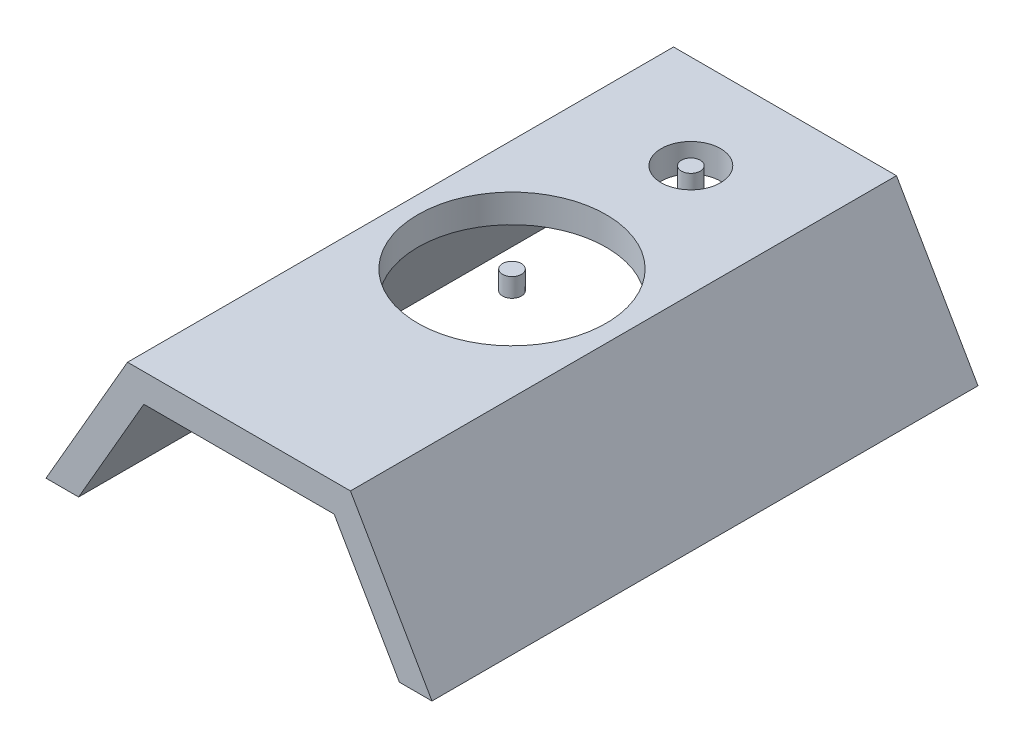
ISO-10303-21;
HEADER;
FILE_DESCRIPTION(('STEP AP214'),'2;1');
FILE_NAME('part.step','',(''),(''),'','','');
FILE_SCHEMA(('AUTOMOTIVE_DESIGN { 1 0 10303 214 1 1 1 1 }'));
ENDSEC;
DATA;
#1=APPLICATION_CONTEXT('core data for automotive mechanical design processes');
#2=APPLICATION_PROTOCOL_DEFINITION('international standard','automotive_design',2000,#1);
#3=PRODUCT_CONTEXT('',#1,'mechanical');
#4=PRODUCT('Part','Part','',(#3));
#5=PRODUCT_RELATED_PRODUCT_CATEGORY('part','',(#4));
#6=PRODUCT_DEFINITION_FORMATION('','',#4);
#7=PRODUCT_DEFINITION_CONTEXT('part definition',#1,'design');
#8=PRODUCT_DEFINITION('design','',#6,#7);
#9=PRODUCT_DEFINITION_SHAPE('','',#8);
#10=(LENGTH_UNIT() NAMED_UNIT(*) SI_UNIT(.MILLI.,.METRE.));
#11=(NAMED_UNIT(*) PLANE_ANGLE_UNIT() SI_UNIT($,.RADIAN.));
#12=(NAMED_UNIT(*) SI_UNIT($,.STERADIAN.) SOLID_ANGLE_UNIT());
#13=UNCERTAINTY_MEASURE_WITH_UNIT(LENGTH_MEASURE(1.E-05),#10,'distance_accuracy_value','');
#14=(GEOMETRIC_REPRESENTATION_CONTEXT(3) GLOBAL_UNCERTAINTY_ASSIGNED_CONTEXT((#13)) GLOBAL_UNIT_ASSIGNED_CONTEXT((#10,
#11,#12)) REPRESENTATION_CONTEXT('',''));
#15=CARTESIAN_POINT('',(0.,0.,0.));
#16=DIRECTION('',(0.,0.,1.));
#17=DIRECTION('',(1.,0.,0.));
#18=AXIS2_PLACEMENT_3D('',#15,#16,#17);
#19=CARTESIAN_POINT('',(118.403810791249,10.,100.));
#20=DIRECTION('',(0.,1.,0.));
#21=DIRECTION('',(-1.,0.,0.));
#22=AXIS2_PLACEMENT_3D('',#19,#20,#21);
#23=CYLINDRICAL_SURFACE('',#22,9.99999999999999);
#24=CARTESIAN_POINT('',(118.403810791249,10.,100.));
#25=DIRECTION('',(0.,1.,0.));
#26=DIRECTION('',(-1.,0.,0.));
#27=AXIS2_PLACEMENT_3D('',#24,#25,#26);
#28=CIRCLE('',#27,9.99999999999999);
#29=CARTESIAN_POINT('',(108.403810791249,10.,100.));
#30=VERTEX_POINT('',#29);
#31=EDGE_CURVE('E11',#30,#30,#28,.T.);
#32=ORIENTED_EDGE('',*,*,#31,.T.);
#33=EDGE_LOOP('',(#32));
#34=FACE_BOUND('',#33,.T.);
#35=CARTESIAN_POINT('',(118.403810791249,30.,100.));
#36=DIRECTION('',(0.,1.,0.));
#37=DIRECTION('',(-1.,0.,0.));
#38=AXIS2_PLACEMENT_3D('',#35,#36,#37);
#39=CIRCLE('',#38,9.99999999999999);
#40=CARTESIAN_POINT('',(108.403810791249,30.,100.));
#41=VERTEX_POINT('',#40);
#42=EDGE_CURVE('E47',#41,#41,#39,.T.);
#43=ORIENTED_EDGE('',*,*,#42,.F.);
#44=EDGE_LOOP('',(#43));
#45=FACE_BOUND('',#44,.T.);
#46=ADVANCED_FACE('F44',(#34,#45),#23,.T.);
#47=CARTESIAN_POINT('',(118.403810791249,10.,100.));
#48=DIRECTION('',(0.,1.,0.));
#49=DIRECTION('',(-1.,0.,0.));
#50=AXIS2_PLACEMENT_3D('',#47,#48,#49);
#51=PLANE('',#50);
#52=ORIENTED_EDGE('',*,*,#31,.F.);
#53=EDGE_LOOP('',(#52));
#54=FACE_BOUND('',#53,.T.);
#55=ADVANCED_FACE('F59',(#54),#51,.F.);
#56=CARTESIAN_POINT('',(118.403810791249,30.,100.));
#57=DIRECTION('',(0.,1.,0.));
#58=DIRECTION('',(-1.,0.,0.));
#59=AXIS2_PLACEMENT_3D('',#56,#57,#58);
#60=PLANE('',#59);
#61=ORIENTED_EDGE('',*,*,#42,.T.);
#62=EDGE_LOOP('',(#61));
#63=FACE_BOUND('',#62,.T.);
#64=ADVANCED_FACE('F56',(#63),#60,.T.);
#65=CLOSED_SHELL('',(#46,#55,#64));
#66=MANIFOLD_SOLID_BREP('B2',#65);
#67=CARTESIAN_POINT('',(118.403810791249,10.,290.));
#68=DIRECTION('',(0.,1.,0.));
#69=DIRECTION('',(-1.,0.,0.));
#70=AXIS2_PLACEMENT_3D('',#67,#68,#69);
#71=CYLINDRICAL_SURFACE('',#70,10.);
#72=CARTESIAN_POINT('',(118.403810791249,10.,290.));
#73=DIRECTION('',(0.,1.,0.));
#74=DIRECTION('',(-1.,0.,0.));
#75=AXIS2_PLACEMENT_3D('',#72,#73,#74);
#76=CIRCLE('',#75,10.);
#77=CARTESIAN_POINT('',(108.403810791249,10.,290.));
#78=VERTEX_POINT('',#77);
#79=EDGE_CURVE('E43',#78,#78,#76,.T.);
#80=ORIENTED_EDGE('',*,*,#79,.T.);
#81=EDGE_LOOP('',(#80));
#82=FACE_BOUND('',#81,.T.);
#83=CARTESIAN_POINT('',(118.403810791249,30.,290.));
#84=DIRECTION('',(0.,1.,0.));
#85=DIRECTION('',(-1.,0.,0.));
#86=AXIS2_PLACEMENT_3D('',#83,#84,#85);
#87=CIRCLE('',#86,10.);
#88=CARTESIAN_POINT('',(108.403810791249,30.,290.));
#89=VERTEX_POINT('',#88);
#90=EDGE_CURVE('E96',#89,#89,#87,.T.);
#91=ORIENTED_EDGE('',*,*,#90,.F.);
#92=EDGE_LOOP('',(#91));
#93=FACE_BOUND('',#92,.T.);
#94=ADVANCED_FACE('F93',(#82,#93),#71,.T.);
#95=CARTESIAN_POINT('',(118.403810791249,10.,290.));
#96=DIRECTION('',(0.,1.,0.));
#97=DIRECTION('',(-1.,0.,0.));
#98=AXIS2_PLACEMENT_3D('',#95,#96,#97);
#99=PLANE('',#98);
#100=ORIENTED_EDGE('',*,*,#79,.F.);
#101=EDGE_LOOP('',(#100));
#102=FACE_BOUND('',#101,.T.);
#103=ADVANCED_FACE('F108',(#102),#99,.F.);
#104=CARTESIAN_POINT('',(118.403810791249,30.,290.));
#105=DIRECTION('',(0.,1.,0.));
#106=DIRECTION('',(-1.,0.,0.));
#107=AXIS2_PLACEMENT_3D('',#104,#105,#106);
#108=PLANE('',#107);
#109=ORIENTED_EDGE('',*,*,#90,.T.);
#110=EDGE_LOOP('',(#109));
#111=FACE_BOUND('',#110,.T.);
#112=ADVANCED_FACE('F105',(#111),#108,.T.);
#113=CLOSED_SHELL('',(#94,#103,#112));
#114=MANIFOLD_SOLID_BREP('B6',#113);
#115=CARTESIAN_POINT('',(-12.9896188202629,7.49867992255546,580.));
#116=DIRECTION('',(0.866050808314088,-0.499955995482118,0.));
#117=DIRECTION('',(0.499955995482118,0.866050808314088,0.));
#118=AXIS2_PLACEMENT_3D('',#115,#116,#117);
#119=PLANE('',#118);
#120=DIRECTION('',(-0.499955995482118,-0.866050808314088,0.));
#121=VECTOR('',#120,1.);
#122=CARTESIAN_POINT('',(-12.9896188202629,7.49867992255546,0.));
#123=LINE('',#122,#121);
#124=CARTESIAN_POINT('',(0.,30.,0.));
#125=VERTEX_POINT('',#124);
#126=CARTESIAN_POINT('',(-86.5923784175028,-120.,0.));
#127=VERTEX_POINT('',#126);
#128=EDGE_CURVE('E229',#125,#127,#123,.T.);
#129=ORIENTED_EDGE('',*,*,#128,.T.);
#130=DIRECTION('',(0.,0.,-1.));
#131=VECTOR('',#130,1.);
#132=CARTESIAN_POINT('',(-86.5923784175028,-120.,580.));
#133=LINE('',#132,#131);
#134=CARTESIAN_POINT('',(-86.5923784175028,-120.,580.));
#135=VERTEX_POINT('',#134);
#136=EDGE_CURVE('E91',#135,#127,#133,.T.);
#137=ORIENTED_EDGE('',*,*,#136,.F.);
#138=DIRECTION('',(-0.499955995482118,-0.866050808314088,0.));
#139=VECTOR('',#138,1.);
#140=CARTESIAN_POINT('',(-12.9896188202629,7.49867992255546,580.));
#141=LINE('',#140,#139);
#142=CARTESIAN_POINT('',(0.,30.,580.));
#143=VERTEX_POINT('',#142);
#144=EDGE_CURVE('E249',#143,#135,#141,.T.);
#145=ORIENTED_EDGE('',*,*,#144,.F.);
#146=DIRECTION('',(0.,0.,-1.));
#147=VECTOR('',#146,1.);
#148=CARTESIAN_POINT('',(0.,30.,580.));
#149=LINE('',#148,#147);
#150=EDGE_CURVE('E149',#143,#125,#149,.T.);
#151=ORIENTED_EDGE('',*,*,#150,.T.);
#152=EDGE_LOOP('',(#129,#137,#145,#151));
#153=FACE_BOUND('',#152,.T.);
#154=ADVANCED_FACE('F133',(#153),#119,.F.);
#155=CARTESIAN_POINT('',(0.,-120.,580.));
#156=DIRECTION('',(0.,1.,0.));
#157=DIRECTION('',(0.,0.,1.));
#158=AXIS2_PLACEMENT_3D('',#155,#156,#157);
#159=PLANE('',#158);
#160=DIRECTION('',(1.,0.,0.));
#161=VECTOR('',#160,1.);
#162=CARTESIAN_POINT('',(0.,-120.,0.));
#163=LINE('',#162,#161);
#164=CARTESIAN_POINT('',(-51.9554270505017,-120.,0.));
#165=VERTEX_POINT('',#164);
#166=EDGE_CURVE('E231',#127,#165,#163,.T.);
#167=ORIENTED_EDGE('',*,*,#166,.T.);
#168=DIRECTION('',(0.,0.,-1.));
#169=VECTOR('',#168,1.);
#170=CARTESIAN_POINT('',(-51.9554270505017,-120.,580.));
#171=LINE('',#170,#169);
#172=CARTESIAN_POINT('',(-51.9554270505017,-120.,580.));
#173=VERTEX_POINT('',#172);
#174=EDGE_CURVE('E141',#173,#165,#171,.T.);
#175=ORIENTED_EDGE('',*,*,#174,.F.);
#176=DIRECTION('',(1.,0.,0.));
#177=VECTOR('',#176,1.);
#178=CARTESIAN_POINT('',(0.,-120.,580.));
#179=LINE('',#178,#177);
#180=EDGE_CURVE('E187',#135,#173,#179,.T.);
#181=ORIENTED_EDGE('',*,*,#180,.F.);
#182=ORIENTED_EDGE('',*,*,#136,.T.);
#183=EDGE_LOOP('',(#167,#175,#181,#182));
#184=FACE_BOUND('',#183,.T.);
#185=ADVANCED_FACE('F263',(#184),#159,.F.);
#186=CARTESIAN_POINT('',(12.9896188202629,-7.49867992255546,580.));
#187=DIRECTION('',(0.866050808314088,-0.499955995482118,0.));
#188=DIRECTION('',(0.499955995482118,0.866050808314088,0.));
#189=AXIS2_PLACEMENT_3D('',#186,#187,#188);
#190=PLANE('',#189);
#191=DIRECTION('',(-0.499955995482118,-0.866050808314088,0.));
#192=VECTOR('',#191,1.);
#193=CARTESIAN_POINT('',(12.9896188202629,-7.49867992255546,0.));
#194=LINE('',#193,#192);
#195=CARTESIAN_POINT('',(17.3184756835006,0.,0.));
#196=VERTEX_POINT('',#195);
#197=EDGE_CURVE('E235',#196,#165,#194,.T.);
#198=ORIENTED_EDGE('',*,*,#197,.F.);
#199=DIRECTION('',(0.,0.,-1.));
#200=VECTOR('',#199,1.);
#201=CARTESIAN_POINT('',(17.3184756835006,0.,580.));
#202=LINE('',#201,#200);
#203=CARTESIAN_POINT('',(17.3184756835006,0.,580.));
#204=VERTEX_POINT('',#203);
#205=EDGE_CURVE('E256',#204,#196,#202,.T.);
#206=ORIENTED_EDGE('',*,*,#205,.F.);
#207=DIRECTION('',(-0.499955995482118,-0.866050808314088,0.));
#208=VECTOR('',#207,1.);
#209=CARTESIAN_POINT('',(12.9896188202629,-7.49867992255546,580.));
#210=LINE('',#209,#208);
#211=EDGE_CURVE('E262',#204,#173,#210,.T.);
#212=ORIENTED_EDGE('',*,*,#211,.T.);
#213=ORIENTED_EDGE('',*,*,#174,.T.);
#214=EDGE_LOOP('',(#198,#206,#212,#213));
#215=FACE_BOUND('',#214,.T.);
#216=ADVANCED_FACE('F260',(#215),#190,.T.);
#217=CARTESIAN_POINT('',(0.,0.,580.));
#218=DIRECTION('',(0.,1.,0.));
#219=DIRECTION('',(-1.,0.,0.));
#220=AXIS2_PLACEMENT_3D('',#217,#218,#219);
#221=PLANE('',#220);
#222=CARTESIAN_POINT('',(118.403810791249,0.,100.));
#223=DIRECTION('',(0.,1.,0.));
#224=DIRECTION('',(-1.,0.,0.));
#225=AXIS2_PLACEMENT_3D('',#222,#223,#224);
#226=CIRCLE('',#225,31.5);
#227=CARTESIAN_POINT('',(86.9038107912486,0.,100.));
#228=VERTEX_POINT('',#227);
#229=EDGE_CURVE('E286',#228,#228,#226,.F.);
#230=ORIENTED_EDGE('',*,*,#229,.F.);
#231=EDGE_LOOP('',(#230));
#232=FACE_BOUND('',#231,.T.);
#233=CARTESIAN_POINT('',(118.403810791249,0.,290.));
#234=DIRECTION('',(0.,1.,0.));
#235=DIRECTION('',(-1.,0.,0.));
#236=AXIS2_PLACEMENT_3D('',#233,#234,#235);
#237=CIRCLE('',#236,100.);
#238=CARTESIAN_POINT('',(18.4038107912486,0.,290.));
#239=VERTEX_POINT('',#238);
#240=EDGE_CURVE('E232',#239,#239,#237,.F.);
#241=ORIENTED_EDGE('',*,*,#240,.F.);
#242=EDGE_LOOP('',(#241));
#243=FACE_BOUND('',#242,.T.);
#244=DIRECTION('',(1.,0.,0.));
#245=VECTOR('',#244,1.);
#246=CARTESIAN_POINT('',(0.,0.,0.));
#247=LINE('',#246,#245);
#248=CARTESIAN_POINT('',(219.489145898997,0.,0.));
#249=VERTEX_POINT('',#248);
#250=EDGE_CURVE('E238',#196,#249,#247,.T.);
#251=ORIENTED_EDGE('',*,*,#250,.T.);
#252=DIRECTION('',(0.,0.,-1.));
#253=VECTOR('',#252,1.);
#254=CARTESIAN_POINT('',(219.489145898997,0.,580.));
#255=LINE('',#254,#253);
#256=CARTESIAN_POINT('',(219.489145898997,0.,580.));
#257=VERTEX_POINT('',#256);
#258=EDGE_CURVE('E253',#257,#249,#255,.T.);
#259=ORIENTED_EDGE('',*,*,#258,.F.);
#260=DIRECTION('',(1.,0.,0.));
#261=VECTOR('',#260,1.);
#262=CARTESIAN_POINT('',(0.,0.,580.));
#263=LINE('',#262,#261);
#264=EDGE_CURVE('E275',#204,#257,#263,.T.);
#265=ORIENTED_EDGE('',*,*,#264,.F.);
#266=ORIENTED_EDGE('',*,*,#205,.T.);
#267=EDGE_LOOP('',(#251,#259,#265,#266));
#268=FACE_BOUND('',#267,.T.);
#269=ADVANCED_FACE('F271',(#232,#243,#268),#221,.F.);
#270=CARTESIAN_POINT('',(164.626517513275,95.0360113471011,580.));
#271=DIRECTION('',(0.866050808314087,0.499955995482118,0.));
#272=DIRECTION('',(-0.499955995482118,0.866050808314087,0.));
#273=AXIS2_PLACEMENT_3D('',#270,#271,#272);
#274=PLANE('',#273);
#275=DIRECTION('',(0.499955995482118,-0.866050808314087,0.));
#276=VECTOR('',#275,1.);
#277=CARTESIAN_POINT('',(164.626517513275,95.0360113471011,0.));
#278=LINE('',#277,#276);
#279=CARTESIAN_POINT('',(288.763048632999,-120.,0.));
#280=VERTEX_POINT('',#279);
#281=EDGE_CURVE('E240',#249,#280,#278,.T.);
#282=ORIENTED_EDGE('',*,*,#281,.T.);
#283=DIRECTION('',(0.,0.,-1.));
#284=VECTOR('',#283,1.);
#285=CARTESIAN_POINT('',(288.763048632999,-120.,580.));
#286=LINE('',#285,#284);
#287=CARTESIAN_POINT('',(288.763048632999,-120.,580.));
#288=VERTEX_POINT('',#287);
#289=EDGE_CURVE('E212',#288,#280,#286,.T.);
#290=ORIENTED_EDGE('',*,*,#289,.F.);
#291=DIRECTION('',(0.499955995482118,-0.866050808314087,0.));
#292=VECTOR('',#291,1.);
#293=CARTESIAN_POINT('',(164.626517513275,95.0360113471011,580.));
#294=LINE('',#293,#292);
#295=EDGE_CURVE('E220',#257,#288,#294,.T.);
#296=ORIENTED_EDGE('',*,*,#295,.F.);
#297=ORIENTED_EDGE('',*,*,#258,.T.);
#298=EDGE_LOOP('',(#282,#290,#296,#297));
#299=FACE_BOUND('',#298,.T.);
#300=ADVANCED_FACE('F274',(#299),#274,.F.);
#301=CARTESIAN_POINT('',(0.,-120.,580.));
#302=DIRECTION('',(0.,-1.,0.));
#303=DIRECTION('',(1.,0.,0.));
#304=AXIS2_PLACEMENT_3D('',#301,#302,#303);
#305=PLANE('',#304);
#306=DIRECTION('',(-1.,0.,0.));
#307=VECTOR('',#306,1.);
#308=CARTESIAN_POINT('',(0.,-120.,0.));
#309=LINE('',#308,#307);
#310=CARTESIAN_POINT('',(323.407621582497,-120.,0.));
#311=VERTEX_POINT('',#310);
#312=EDGE_CURVE('E208',#311,#280,#309,.T.);
#313=ORIENTED_EDGE('',*,*,#312,.F.);
#314=DIRECTION('',(0.,0.,-1.));
#315=VECTOR('',#314,1.);
#316=CARTESIAN_POINT('',(323.407621582497,-120.,580.));
#317=LINE('',#316,#315);
#318=CARTESIAN_POINT('',(323.407621582497,-120.,580.));
#319=VERTEX_POINT('',#318);
#320=EDGE_CURVE('E203',#319,#311,#317,.T.);
#321=ORIENTED_EDGE('',*,*,#320,.F.);
#322=DIRECTION('',(-1.,0.,0.));
#323=VECTOR('',#322,1.);
#324=CARTESIAN_POINT('',(0.,-120.,580.));
#325=LINE('',#324,#323);
#326=EDGE_CURVE('E206',#319,#288,#325,.T.);
#327=ORIENTED_EDGE('',*,*,#326,.T.);
#328=ORIENTED_EDGE('',*,*,#289,.T.);
#329=EDGE_LOOP('',(#313,#321,#327,#328));
#330=FACE_BOUND('',#329,.T.);
#331=ADVANCED_FACE('F205',(#330),#305,.T.);
#332=CARTESIAN_POINT('',(190.59851163171,110.038874048707,580.));
#333=DIRECTION('',(0.86603175470726,0.499988999717658,0.));
#334=DIRECTION('',(-0.499988999717658,0.86603175470726,0.));
#335=AXIS2_PLACEMENT_3D('',#332,#333,#334);
#336=PLANE('',#335);
#337=DIRECTION('',(0.499988999717658,-0.86603175470726,0.));
#338=VECTOR('',#337,1.);
#339=CARTESIAN_POINT('',(190.59851163171,110.038874048707,0.));
#340=LINE('',#339,#338);
#341=CARTESIAN_POINT('',(236.807621582497,30.,0.));
#342=VERTEX_POINT('',#341);
#343=EDGE_CURVE('E244',#342,#311,#340,.T.);
#344=ORIENTED_EDGE('',*,*,#343,.F.);
#345=DIRECTION('',(0.,0.,-1.));
#346=VECTOR('',#345,1.);
#347=CARTESIAN_POINT('',(236.807621582497,30.,580.));
#348=LINE('',#347,#346);
#349=CARTESIAN_POINT('',(236.807621582497,30.,580.));
#350=VERTEX_POINT('',#349);
#351=EDGE_CURVE('E175',#350,#342,#348,.T.);
#352=ORIENTED_EDGE('',*,*,#351,.F.);
#353=DIRECTION('',(0.499988999717658,-0.86603175470726,0.));
#354=VECTOR('',#353,1.);
#355=CARTESIAN_POINT('',(190.59851163171,110.038874048707,580.));
#356=LINE('',#355,#354);
#357=EDGE_CURVE('E218',#350,#319,#356,.T.);
#358=ORIENTED_EDGE('',*,*,#357,.T.);
#359=ORIENTED_EDGE('',*,*,#320,.T.);
#360=EDGE_LOOP('',(#344,#352,#358,#359));
#361=FACE_BOUND('',#360,.T.);
#362=ADVANCED_FACE('F223',(#361),#336,.T.);
#363=CARTESIAN_POINT('',(0.,30.,580.));
#364=DIRECTION('',(0.,1.,0.));
#365=DIRECTION('',(-1.,0.,0.));
#366=AXIS2_PLACEMENT_3D('',#363,#364,#365);
#367=PLANE('',#366);
#368=CARTESIAN_POINT('',(118.403810791249,30.,100.));
#369=DIRECTION('',(0.,1.,0.));
#370=DIRECTION('',(-1.,0.,0.));
#371=AXIS2_PLACEMENT_3D('',#368,#369,#370);
#372=CIRCLE('',#371,31.5);
#373=CARTESIAN_POINT('',(86.9038107912486,30.,100.));
#374=VERTEX_POINT('',#373);
#375=EDGE_CURVE('E289',#374,#374,#372,.T.);
#376=ORIENTED_EDGE('',*,*,#375,.F.);
#377=EDGE_LOOP('',(#376));
#378=FACE_BOUND('',#377,.T.);
#379=CARTESIAN_POINT('',(118.403810791249,30.,290.));
#380=DIRECTION('',(0.,1.,0.));
#381=DIRECTION('',(-1.,0.,0.));
#382=AXIS2_PLACEMENT_3D('',#379,#380,#381);
#383=CIRCLE('',#382,100.);
#384=CARTESIAN_POINT('',(18.4038107912486,30.,290.));
#385=VERTEX_POINT('',#384);
#386=EDGE_CURVE('E283',#385,#385,#383,.T.);
#387=ORIENTED_EDGE('',*,*,#386,.F.);
#388=EDGE_LOOP('',(#387));
#389=FACE_BOUND('',#388,.T.);
#390=DIRECTION('',(1.,0.,0.));
#391=VECTOR('',#390,1.);
#392=CARTESIAN_POINT('',(0.,30.,0.));
#393=LINE('',#392,#391);
#394=EDGE_CURVE('E246',#125,#342,#393,.T.);
#395=ORIENTED_EDGE('',*,*,#394,.F.);
#396=ORIENTED_EDGE('',*,*,#150,.F.);
#397=DIRECTION('',(1.,0.,0.));
#398=VECTOR('',#397,1.);
#399=CARTESIAN_POINT('',(0.,30.,580.));
#400=LINE('',#399,#398);
#401=EDGE_CURVE('E224',#143,#350,#400,.T.);
#402=ORIENTED_EDGE('',*,*,#401,.T.);
#403=ORIENTED_EDGE('',*,*,#351,.T.);
#404=EDGE_LOOP('',(#395,#396,#402,#403));
#405=FACE_BOUND('',#404,.T.);
#406=ADVANCED_FACE('F296',(#378,#389,#405),#367,.T.);
#407=CARTESIAN_POINT('',(0.,0.,580.));
#408=DIRECTION('',(0.,0.,1.));
#409=DIRECTION('',(1.,0.,0.));
#410=AXIS2_PLACEMENT_3D('',#407,#408,#409);
#411=PLANE('',#410);
#412=ORIENTED_EDGE('',*,*,#144,.T.);
#413=ORIENTED_EDGE('',*,*,#180,.T.);
#414=ORIENTED_EDGE('',*,*,#211,.F.);
#415=ORIENTED_EDGE('',*,*,#264,.T.);
#416=ORIENTED_EDGE('',*,*,#295,.T.);
#417=ORIENTED_EDGE('',*,*,#326,.F.);
#418=ORIENTED_EDGE('',*,*,#357,.F.);
#419=ORIENTED_EDGE('',*,*,#401,.F.);
#420=EDGE_LOOP('',(#412,#413,#414,#415,#416,#417,#418,#419));
#421=FACE_BOUND('',#420,.T.);
#422=ADVANCED_FACE('F216',(#421),#411,.T.);
#423=CARTESIAN_POINT('',(0.,0.,0.));
#424=DIRECTION('',(0.,0.,1.));
#425=DIRECTION('',(1.,0.,0.));
#426=AXIS2_PLACEMENT_3D('',#423,#424,#425);
#427=PLANE('',#426);
#428=ORIENTED_EDGE('',*,*,#128,.F.);
#429=ORIENTED_EDGE('',*,*,#394,.T.);
#430=ORIENTED_EDGE('',*,*,#343,.T.);
#431=ORIENTED_EDGE('',*,*,#312,.T.);
#432=ORIENTED_EDGE('',*,*,#281,.F.);
#433=ORIENTED_EDGE('',*,*,#250,.F.);
#434=ORIENTED_EDGE('',*,*,#197,.T.);
#435=ORIENTED_EDGE('',*,*,#166,.F.);
#436=EDGE_LOOP('',(#428,#429,#430,#431,#432,#433,#434,#435));
#437=FACE_BOUND('',#436,.T.);
#438=ADVANCED_FACE('F267',(#437),#427,.F.);
#439=CARTESIAN_POINT('',(118.403810791249,-120.001,290.));
#440=DIRECTION('',(0.,1.,0.));
#441=DIRECTION('',(-1.,0.,0.));
#442=AXIS2_PLACEMENT_3D('',#439,#440,#441);
#443=CYLINDRICAL_SURFACE('',#442,100.);
#444=ORIENTED_EDGE('',*,*,#386,.T.);
#445=EDGE_LOOP('',(#444));
#446=FACE_BOUND('',#445,.T.);
#447=ORIENTED_EDGE('',*,*,#240,.T.);
#448=EDGE_LOOP('',(#447));
#449=FACE_BOUND('',#448,.T.);
#450=ADVANCED_FACE('F321',(#446,#449),#443,.F.);
#451=CARTESIAN_POINT('',(118.403810791249,-120.001,100.));
#452=DIRECTION('',(0.,1.,0.));
#453=DIRECTION('',(-1.,0.,0.));
#454=AXIS2_PLACEMENT_3D('',#451,#452,#453);
#455=CYLINDRICAL_SURFACE('',#454,31.5);
#456=ORIENTED_EDGE('',*,*,#375,.T.);
#457=EDGE_LOOP('',(#456));
#458=FACE_BOUND('',#457,.T.);
#459=ORIENTED_EDGE('',*,*,#229,.T.);
#460=EDGE_LOOP('',(#459));
#461=FACE_BOUND('',#460,.T.);
#462=ADVANCED_FACE('F293',(#458,#461),#455,.F.);
#463=CLOSED_SHELL('',(#154,#185,#216,#269,#300,#331,#362,#406,#422,#438,#450,#462));
#464=MANIFOLD_SOLID_BREP('B38',#463);
#465=ADVANCED_BREP_SHAPE_REPRESENTATION('',(#18,#66,#114,#464),#14);
#466=SHAPE_DEFINITION_REPRESENTATION(#9,#465);
ENDSEC;
END-ISO-10303-21;
